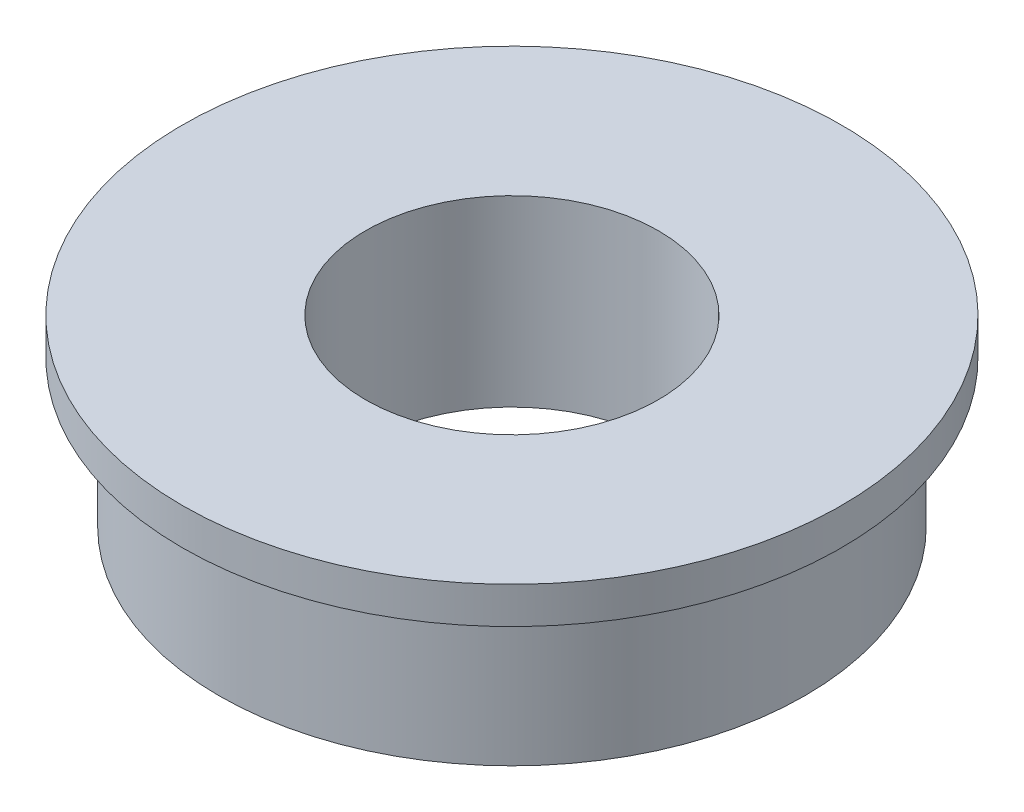
ISO-10303-21;
HEADER;
FILE_DESCRIPTION(('STEP AP214'),'2;1');
FILE_NAME('part.step','',(''),(''),'','','');
FILE_SCHEMA(('AUTOMOTIVE_DESIGN { 1 0 10303 214 1 1 1 1 }'));
ENDSEC;
DATA;
#1=APPLICATION_CONTEXT('core data for automotive mechanical design processes');
#2=APPLICATION_PROTOCOL_DEFINITION('international standard','automotive_design',2000,#1);
#3=PRODUCT_CONTEXT('',#1,'mechanical');
#4=PRODUCT('Part','Part','',(#3));
#5=PRODUCT_RELATED_PRODUCT_CATEGORY('part','',(#4));
#6=PRODUCT_DEFINITION_FORMATION('','',#4);
#7=PRODUCT_DEFINITION_CONTEXT('part definition',#1,'design');
#8=PRODUCT_DEFINITION('design','',#6,#7);
#9=PRODUCT_DEFINITION_SHAPE('','',#8);
#10=(LENGTH_UNIT() NAMED_UNIT(*) SI_UNIT(.MILLI.,.METRE.));
#11=(NAMED_UNIT(*) PLANE_ANGLE_UNIT() SI_UNIT($,.RADIAN.));
#12=(NAMED_UNIT(*) SI_UNIT($,.STERADIAN.) SOLID_ANGLE_UNIT());
#13=UNCERTAINTY_MEASURE_WITH_UNIT(LENGTH_MEASURE(1.E-05),#10,'distance_accuracy_value','');
#14=(GEOMETRIC_REPRESENTATION_CONTEXT(3) GLOBAL_UNCERTAINTY_ASSIGNED_CONTEXT((#13)) GLOBAL_UNIT_ASSIGNED_CONTEXT((#10,
#11,#12)) REPRESENTATION_CONTEXT('',''));
#15=CARTESIAN_POINT('',(0.,0.,0.));
#16=DIRECTION('',(0.,0.,1.));
#17=DIRECTION('',(1.,0.,0.));
#18=AXIS2_PLACEMENT_3D('',#15,#16,#17);
#19=CARTESIAN_POINT('',(0.,0.,0.));
#20=DIRECTION('',(0.,1.,0.));
#21=DIRECTION('',(0.,0.,1.));
#22=AXIS2_PLACEMENT_3D('',#19,#20,#21);
#23=PLANE('',#22);
#24=CARTESIAN_POINT('',(0.,0.,0.));
#25=DIRECTION('',(0.,1.,0.));
#26=DIRECTION('',(0.,0.,1.));
#27=AXIS2_PLACEMENT_3D('',#24,#25,#26);
#28=CIRCLE('',#27,8.);
#29=CARTESIAN_POINT('',(0.,0.,8.));
#30=VERTEX_POINT('',#29);
#31=EDGE_CURVE('E40',#30,#30,#28,.T.);
#32=ORIENTED_EDGE('',*,*,#31,.F.);
#33=EDGE_LOOP('',(#32));
#34=FACE_BOUND('',#33,.T.);
#35=CARTESIAN_POINT('',(0.,0.,0.));
#36=DIRECTION('',(0.,1.,0.));
#37=DIRECTION('',(0.,0.,1.));
#38=AXIS2_PLACEMENT_3D('',#35,#36,#37);
#39=CIRCLE('',#38,4.);
#40=CARTESIAN_POINT('',(0.,0.,4.));
#41=VERTEX_POINT('',#40);
#42=EDGE_CURVE('E51',#41,#41,#39,.T.);
#43=ORIENTED_EDGE('',*,*,#42,.T.);
#44=EDGE_LOOP('',(#43));
#45=FACE_BOUND('',#44,.T.);
#46=ADVANCED_FACE('F36',(#34,#45),#23,.F.);
#47=CARTESIAN_POINT('',(0.,4.,0.));
#48=DIRECTION('',(0.,-1.,0.));
#49=DIRECTION('',(0.,0.,-1.));
#50=AXIS2_PLACEMENT_3D('',#47,#48,#49);
#51=CYLINDRICAL_SURFACE('',#50,8.);
#52=CARTESIAN_POINT('',(0.,4.,0.));
#53=DIRECTION('',(0.,1.,0.));
#54=DIRECTION('',(0.,0.,1.));
#55=AXIS2_PLACEMENT_3D('',#52,#53,#54);
#56=CIRCLE('',#55,8.);
#57=CARTESIAN_POINT('',(0.,4.,8.));
#58=VERTEX_POINT('',#57);
#59=EDGE_CURVE('E10',#58,#58,#56,.T.);
#60=ORIENTED_EDGE('',*,*,#59,.F.);
#61=EDGE_LOOP('',(#60));
#62=FACE_BOUND('',#61,.T.);
#63=ORIENTED_EDGE('',*,*,#31,.T.);
#64=EDGE_LOOP('',(#63));
#65=FACE_BOUND('',#64,.T.);
#66=ADVANCED_FACE('F38',(#62,#65),#51,.T.);
#67=CARTESIAN_POINT('',(0.,4.,0.));
#68=DIRECTION('',(0.,-1.,0.));
#69=DIRECTION('',(0.,0.,-1.));
#70=AXIS2_PLACEMENT_3D('',#67,#68,#69);
#71=CYLINDRICAL_SURFACE('',#70,4.);
#72=ORIENTED_EDGE('',*,*,#42,.F.);
#73=EDGE_LOOP('',(#72));
#74=FACE_BOUND('',#73,.T.);
#75=CARTESIAN_POINT('',(0.,5.,0.));
#76=DIRECTION('',(0.,1.,0.));
#77=DIRECTION('',(0.,0.,1.));
#78=AXIS2_PLACEMENT_3D('',#75,#76,#77);
#79=CIRCLE('',#78,4.);
#80=CARTESIAN_POINT('',(0.,5.,4.));
#81=VERTEX_POINT('',#80);
#82=EDGE_CURVE('E59',#81,#81,#79,.T.);
#83=ORIENTED_EDGE('',*,*,#82,.T.);
#84=EDGE_LOOP('',(#83));
#85=FACE_BOUND('',#84,.T.);
#86=ADVANCED_FACE('F67',(#74,#85),#71,.F.);
#87=CARTESIAN_POINT('',(0.,4.,0.));
#88=DIRECTION('',(0.,1.,0.));
#89=DIRECTION('',(0.,0.,1.));
#90=AXIS2_PLACEMENT_3D('',#87,#88,#89);
#91=PLANE('',#90);
#92=CARTESIAN_POINT('',(0.,4.,0.));
#93=DIRECTION('',(0.,1.,0.));
#94=DIRECTION('',(0.,0.,1.));
#95=AXIS2_PLACEMENT_3D('',#92,#93,#94);
#96=CIRCLE('',#95,9.);
#97=CARTESIAN_POINT('',(0.,4.,9.));
#98=VERTEX_POINT('',#97);
#99=EDGE_CURVE('E56',#98,#98,#96,.T.);
#100=ORIENTED_EDGE('',*,*,#99,.F.);
#101=EDGE_LOOP('',(#100));
#102=FACE_BOUND('',#101,.T.);
#103=ORIENTED_EDGE('',*,*,#59,.T.);
#104=EDGE_LOOP('',(#103));
#105=FACE_BOUND('',#104,.T.);
#106=ADVANCED_FACE('F72',(#102,#105),#91,.F.);
#107=CARTESIAN_POINT('',(0.,5.,0.));
#108=DIRECTION('',(0.,1.,0.));
#109=DIRECTION('',(0.,0.,1.));
#110=AXIS2_PLACEMENT_3D('',#107,#108,#109);
#111=PLANE('',#110);
#112=CARTESIAN_POINT('',(0.,5.,0.));
#113=DIRECTION('',(0.,1.,0.));
#114=DIRECTION('',(0.,0.,1.));
#115=AXIS2_PLACEMENT_3D('',#112,#113,#114);
#116=CIRCLE('',#115,9.);
#117=CARTESIAN_POINT('',(0.,5.,9.));
#118=VERTEX_POINT('',#117);
#119=EDGE_CURVE('E55',#118,#118,#116,.T.);
#120=ORIENTED_EDGE('',*,*,#119,.T.);
#121=EDGE_LOOP('',(#120));
#122=FACE_BOUND('',#121,.T.);
#123=ORIENTED_EDGE('',*,*,#82,.F.);
#124=EDGE_LOOP('',(#123));
#125=FACE_BOUND('',#124,.T.);
#126=ADVANCED_FACE('F69',(#122,#125),#111,.T.);
#127=CARTESIAN_POINT('',(0.,5.,0.));
#128=DIRECTION('',(0.,-1.,0.));
#129=DIRECTION('',(0.,0.,-1.));
#130=AXIS2_PLACEMENT_3D('',#127,#128,#129);
#131=CYLINDRICAL_SURFACE('',#130,9.);
#132=ORIENTED_EDGE('',*,*,#119,.F.);
#133=EDGE_LOOP('',(#132));
#134=FACE_BOUND('',#133,.T.);
#135=ORIENTED_EDGE('',*,*,#99,.T.);
#136=EDGE_LOOP('',(#135));
#137=FACE_BOUND('',#136,.T.);
#138=ADVANCED_FACE('F71',(#134,#137),#131,.T.);
#139=CLOSED_SHELL('',(#46,#66,#86,#106,#126,#138));
#140=MANIFOLD_SOLID_BREP('B2',#139);
#141=ADVANCED_BREP_SHAPE_REPRESENTATION('',(#18,#140),#14);
#142=SHAPE_DEFINITION_REPRESENTATION(#9,#141);
ENDSEC;
END-ISO-10303-21;
